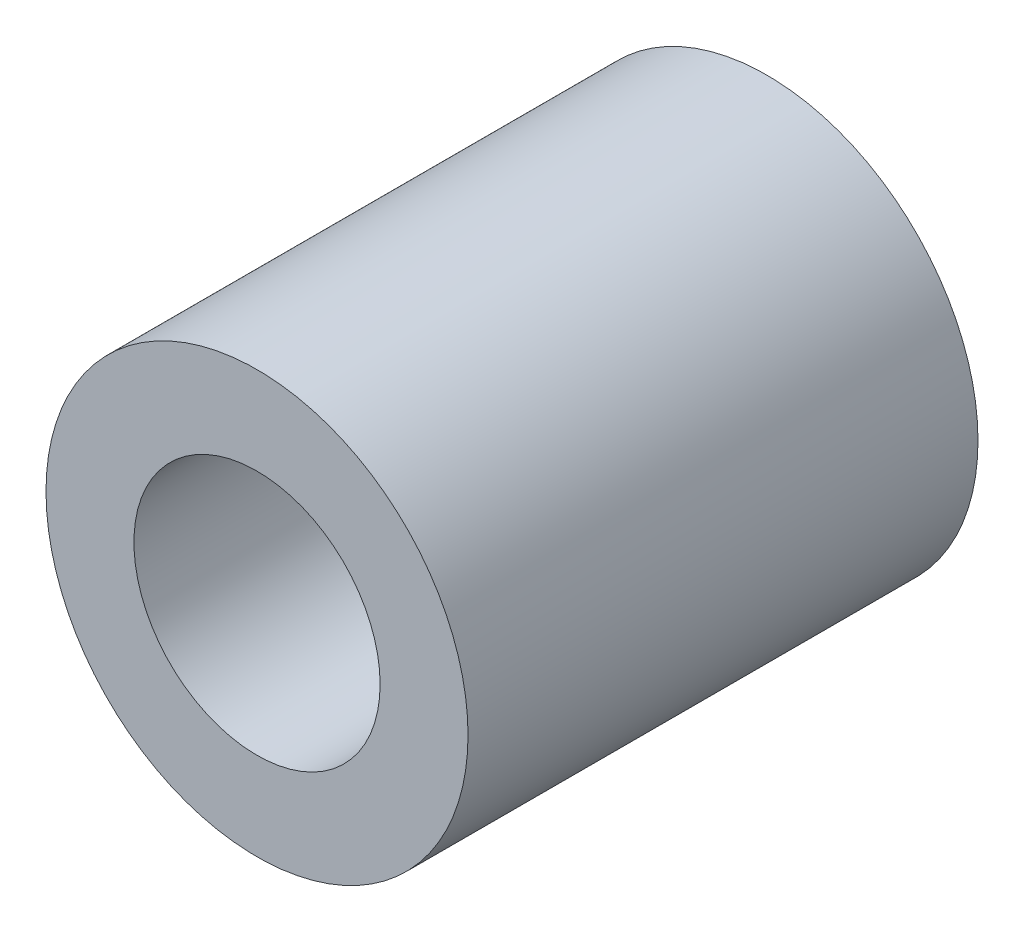
ISO-10303-21;
HEADER;
FILE_DESCRIPTION(('STEP AP214'),'2;1');
FILE_NAME('part.step','',(''),(''),'','','');
FILE_SCHEMA(('AUTOMOTIVE_DESIGN { 1 0 10303 214 1 1 1 1 }'));
ENDSEC;
DATA;
#1=APPLICATION_CONTEXT('core data for automotive mechanical design processes');
#2=APPLICATION_PROTOCOL_DEFINITION('international standard','automotive_design',2000,#1);
#3=PRODUCT_CONTEXT('',#1,'mechanical');
#4=PRODUCT('Part','Part','',(#3));
#5=PRODUCT_RELATED_PRODUCT_CATEGORY('part','',(#4));
#6=PRODUCT_DEFINITION_FORMATION('','',#4);
#7=PRODUCT_DEFINITION_CONTEXT('part definition',#1,'design');
#8=PRODUCT_DEFINITION('design','',#6,#7);
#9=PRODUCT_DEFINITION_SHAPE('','',#8);
#10=(LENGTH_UNIT() NAMED_UNIT(*) SI_UNIT(.MILLI.,.METRE.));
#11=(NAMED_UNIT(*) PLANE_ANGLE_UNIT() SI_UNIT($,.RADIAN.));
#12=(NAMED_UNIT(*) SI_UNIT($,.STERADIAN.) SOLID_ANGLE_UNIT());
#13=UNCERTAINTY_MEASURE_WITH_UNIT(LENGTH_MEASURE(1.E-05),#10,'distance_accuracy_value','');
#14=(GEOMETRIC_REPRESENTATION_CONTEXT(3) GLOBAL_UNCERTAINTY_ASSIGNED_CONTEXT((#13)) GLOBAL_UNIT_ASSIGNED_CONTEXT((#10,
#11,#12)) REPRESENTATION_CONTEXT('',''));
#15=CARTESIAN_POINT('',(0.,0.,0.));
#16=DIRECTION('',(0.,0.,1.));
#17=DIRECTION('',(1.,0.,0.));
#18=AXIS2_PLACEMENT_3D('',#15,#16,#17);
#19=CARTESIAN_POINT('',(0.,0.,14.5));
#20=DIRECTION('',(0.,0.,1.));
#21=DIRECTION('',(1.,0.,0.));
#22=AXIS2_PLACEMENT_3D('',#19,#20,#21);
#23=PLANE('',#22);
#24=CARTESIAN_POINT('',(0.,0.,14.5));
#25=DIRECTION('',(0.,0.,1.));
#26=DIRECTION('',(1.,0.,0.));
#27=AXIS2_PLACEMENT_3D('',#24,#25,#26);
#28=CIRCLE('',#27,6.);
#29=CARTESIAN_POINT('',(6.,0.,14.5));
#30=VERTEX_POINT('',#29);
#31=EDGE_CURVE('E10',#30,#30,#28,.T.);
#32=ORIENTED_EDGE('',*,*,#31,.T.);
#33=EDGE_LOOP('',(#32));
#34=FACE_BOUND('',#33,.T.);
#35=CARTESIAN_POINT('',(0.,0.,14.5));
#36=DIRECTION('',(0.,0.,1.));
#37=DIRECTION('',(1.,0.,0.));
#38=AXIS2_PLACEMENT_3D('',#35,#36,#37);
#39=CIRCLE('',#38,3.5);
#40=CARTESIAN_POINT('',(3.5,0.,14.5));
#41=VERTEX_POINT('',#40);
#42=EDGE_CURVE('E43',#41,#41,#39,.T.);
#43=ORIENTED_EDGE('',*,*,#42,.F.);
#44=EDGE_LOOP('',(#43));
#45=FACE_BOUND('',#44,.T.);
#46=ADVANCED_FACE('F32',(#34,#45),#23,.T.);
#47=CARTESIAN_POINT('',(0.,0.,0.));
#48=DIRECTION('',(0.,0.,1.));
#49=DIRECTION('',(1.,0.,0.));
#50=AXIS2_PLACEMENT_3D('',#47,#48,#49);
#51=PLANE('',#50);
#52=CARTESIAN_POINT('',(0.,0.,0.));
#53=DIRECTION('',(0.,0.,1.));
#54=DIRECTION('',(1.,0.,0.));
#55=AXIS2_PLACEMENT_3D('',#52,#53,#54);
#56=CIRCLE('',#55,6.);
#57=CARTESIAN_POINT('',(6.,0.,0.));
#58=VERTEX_POINT('',#57);
#59=EDGE_CURVE('E36',#58,#58,#56,.T.);
#60=ORIENTED_EDGE('',*,*,#59,.F.);
#61=EDGE_LOOP('',(#60));
#62=FACE_BOUND('',#61,.T.);
#63=CARTESIAN_POINT('',(0.,0.,0.));
#64=DIRECTION('',(0.,0.,1.));
#65=DIRECTION('',(1.,0.,0.));
#66=AXIS2_PLACEMENT_3D('',#63,#64,#65);
#67=CIRCLE('',#66,3.5);
#68=CARTESIAN_POINT('',(3.5,0.,0.));
#69=VERTEX_POINT('',#68);
#70=EDGE_CURVE('E45',#69,#69,#67,.T.);
#71=ORIENTED_EDGE('',*,*,#70,.T.);
#72=EDGE_LOOP('',(#71));
#73=FACE_BOUND('',#72,.T.);
#74=ADVANCED_FACE('F55',(#62,#73),#51,.F.);
#75=CARTESIAN_POINT('',(0.,0.,14.5));
#76=DIRECTION('',(0.,0.,-1.));
#77=DIRECTION('',(-1.,0.,0.));
#78=AXIS2_PLACEMENT_3D('',#75,#76,#77);
#79=CYLINDRICAL_SURFACE('',#78,6.);
#80=ORIENTED_EDGE('',*,*,#31,.F.);
#81=EDGE_LOOP('',(#80));
#82=FACE_BOUND('',#81,.T.);
#83=ORIENTED_EDGE('',*,*,#59,.T.);
#84=EDGE_LOOP('',(#83));
#85=FACE_BOUND('',#84,.T.);
#86=ADVANCED_FACE('F34',(#82,#85),#79,.T.);
#87=CARTESIAN_POINT('',(0.,0.,14.5));
#88=DIRECTION('',(0.,0.,-1.));
#89=DIRECTION('',(-1.,0.,0.));
#90=AXIS2_PLACEMENT_3D('',#87,#88,#89);
#91=CYLINDRICAL_SURFACE('',#90,3.5);
#92=ORIENTED_EDGE('',*,*,#42,.T.);
#93=EDGE_LOOP('',(#92));
#94=FACE_BOUND('',#93,.T.);
#95=ORIENTED_EDGE('',*,*,#70,.F.);
#96=EDGE_LOOP('',(#95));
#97=FACE_BOUND('',#96,.T.);
#98=ADVANCED_FACE('F51',(#94,#97),#91,.F.);
#99=CLOSED_SHELL('',(#46,#74,#86,#98));
#100=MANIFOLD_SOLID_BREP('B2',#99);
#101=ADVANCED_BREP_SHAPE_REPRESENTATION('',(#18,#100),#14);
#102=SHAPE_DEFINITION_REPRESENTATION(#9,#101);
ENDSEC;
END-ISO-10303-21;
